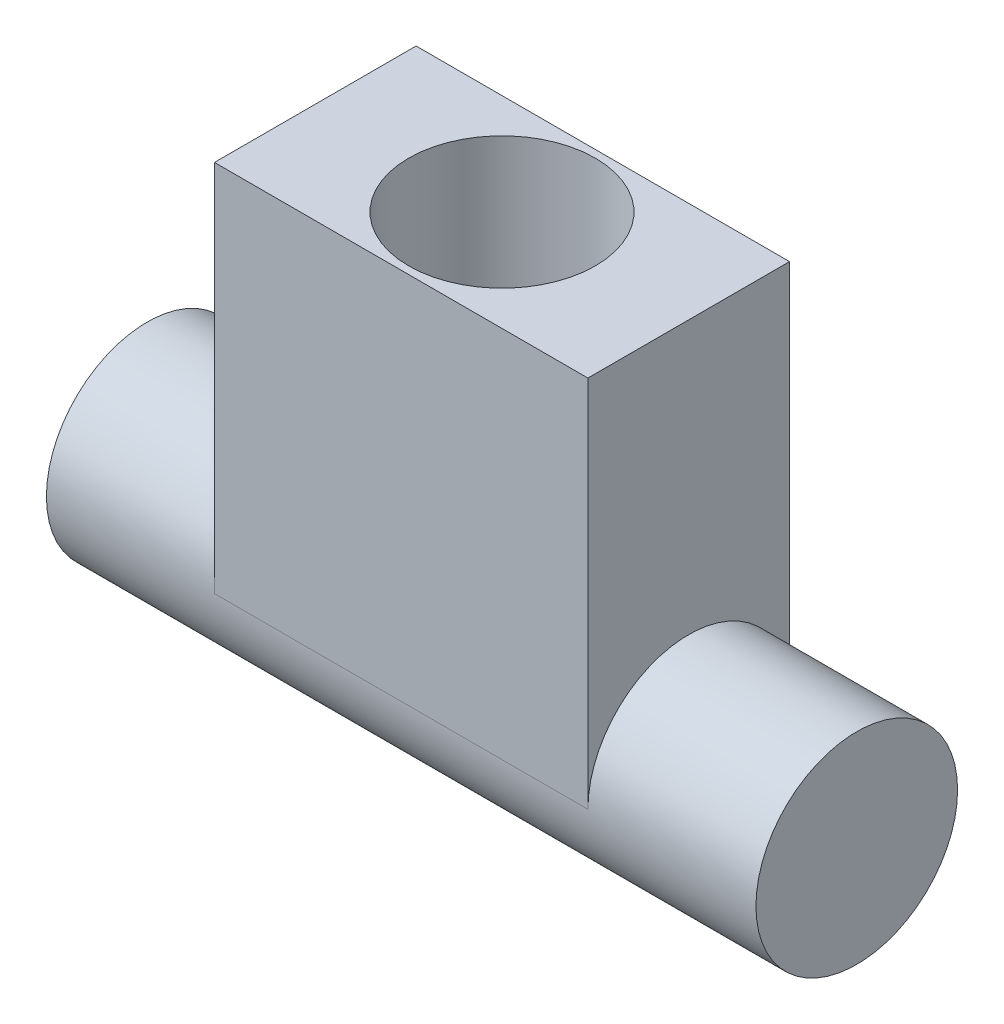
ISO-10303-21;
HEADER;
FILE_DESCRIPTION(('STEP AP214'),'2;1');
FILE_NAME('part.step','',(''),(''),'','','');
FILE_SCHEMA(('AUTOMOTIVE_DESIGN { 1 0 10303 214 1 1 1 1 }'));
ENDSEC;
DATA;
#1=APPLICATION_CONTEXT('core data for automotive mechanical design processes');
#2=APPLICATION_PROTOCOL_DEFINITION('international standard','automotive_design',2000,#1);
#3=PRODUCT_CONTEXT('',#1,'mechanical');
#4=PRODUCT('Part','Part','',(#3));
#5=PRODUCT_RELATED_PRODUCT_CATEGORY('part','',(#4));
#6=PRODUCT_DEFINITION_FORMATION('','',#4);
#7=PRODUCT_DEFINITION_CONTEXT('part definition',#1,'design');
#8=PRODUCT_DEFINITION('design','',#6,#7);
#9=PRODUCT_DEFINITION_SHAPE('','',#8);
#10=(LENGTH_UNIT() NAMED_UNIT(*) SI_UNIT(.MILLI.,.METRE.));
#11=(NAMED_UNIT(*) PLANE_ANGLE_UNIT() SI_UNIT($,.RADIAN.));
#12=(NAMED_UNIT(*) SI_UNIT($,.STERADIAN.) SOLID_ANGLE_UNIT());
#13=UNCERTAINTY_MEASURE_WITH_UNIT(LENGTH_MEASURE(1.E-05),#10,'distance_accuracy_value','');
#14=(GEOMETRIC_REPRESENTATION_CONTEXT(3) GLOBAL_UNCERTAINTY_ASSIGNED_CONTEXT((#13)) GLOBAL_UNIT_ASSIGNED_CONTEXT((#10,
#11,#12)) REPRESENTATION_CONTEXT('',''));
#15=CARTESIAN_POINT('',(0.,0.,0.));
#16=DIRECTION('',(0.,0.,1.));
#17=DIRECTION('',(1.,0.,0.));
#18=AXIS2_PLACEMENT_3D('',#15,#16,#17);
#19=CARTESIAN_POINT('',(19.,0.,0.));
#20=DIRECTION('',(-1.,0.,0.));
#21=DIRECTION('',(0.,0.,1.));
#22=AXIS2_PLACEMENT_3D('',#19,#20,#21);
#23=CYLINDRICAL_SURFACE('',#22,2.7);
#24=CARTESIAN_POINT('',(0.,0.,0.));
#25=DIRECTION('',(1.,0.,0.));
#26=DIRECTION('',(0.,0.,-1.));
#27=AXIS2_PLACEMENT_3D('',#24,#25,#26);
#28=CIRCLE('',#27,2.7);
#29=CARTESIAN_POINT('',(0.,0.,-2.7));
#30=VERTEX_POINT('',#29);
#31=EDGE_CURVE('E91',#30,#30,#28,.T.);
#32=ORIENTED_EDGE('',*,*,#31,.T.);
#33=EDGE_LOOP('',(#32));
#34=FACE_BOUND('',#33,.T.);
#35=CARTESIAN_POINT('',(19.,0.,0.));
#36=DIRECTION('',(1.,0.,0.));
#37=DIRECTION('',(0.,0.,-1.));
#38=AXIS2_PLACEMENT_3D('',#35,#36,#37);
#39=CIRCLE('',#38,2.7);
#40=CARTESIAN_POINT('',(19.,0.,-2.7));
#41=VERTEX_POINT('',#40);
#42=EDGE_CURVE('E94',#41,#41,#39,.T.);
#43=ORIENTED_EDGE('',*,*,#42,.F.);
#44=EDGE_LOOP('',(#43));
#45=FACE_BOUND('',#44,.T.);
#46=CARTESIAN_POINT('',(14.5,0.,0.));
#47=DIRECTION('',(-1.,0.,0.));
#48=DIRECTION('',(0.,0.,1.));
#49=AXIS2_PLACEMENT_3D('',#46,#47,#48);
#50=CIRCLE('',#49,2.7);
#51=CARTESIAN_POINT('',(14.5,0.,2.7));
#52=VERTEX_POINT('',#51);
#53=CARTESIAN_POINT('',(14.5,0.,-2.7));
#54=VERTEX_POINT('',#53);
#55=EDGE_CURVE('E11',#52,#54,#50,.T.);
#56=ORIENTED_EDGE('',*,*,#55,.F.);
#57=DIRECTION('',(1.,0.,0.));
#58=VECTOR('',#57,1.);
#59=CARTESIAN_POINT('',(4.5,0.,2.7));
#60=LINE('',#59,#58);
#61=CARTESIAN_POINT('',(4.5,0.,2.7));
#62=VERTEX_POINT('',#61);
#63=EDGE_CURVE('E88',#62,#52,#60,.T.);
#64=ORIENTED_EDGE('',*,*,#63,.F.);
#65=CARTESIAN_POINT('',(4.5,0.,0.));
#66=DIRECTION('',(1.,0.,0.));
#67=DIRECTION('',(0.,0.,-1.));
#68=AXIS2_PLACEMENT_3D('',#65,#66,#67);
#69=CIRCLE('',#68,2.7);
#70=CARTESIAN_POINT('',(4.5,0.,-2.7));
#71=VERTEX_POINT('',#70);
#72=EDGE_CURVE('E40',#71,#62,#69,.T.);
#73=ORIENTED_EDGE('',*,*,#72,.F.);
#74=DIRECTION('',(-1.,0.,0.));
#75=VECTOR('',#74,1.);
#76=CARTESIAN_POINT('',(4.5,0.,-2.7));
#77=LINE('',#76,#75);
#78=EDGE_CURVE('E47',#54,#71,#77,.T.);
#79=ORIENTED_EDGE('',*,*,#78,.F.);
#80=EDGE_LOOP('',(#56,#64,#73,#79));
#81=FACE_BOUND('',#80,.T.);
#82=ADVANCED_FACE('F33',(#34,#45,#81),#23,.T.);
#83=CARTESIAN_POINT('',(19.,0.,0.));
#84=DIRECTION('',(1.,0.,0.));
#85=DIRECTION('',(0.,0.,-1.));
#86=AXIS2_PLACEMENT_3D('',#83,#84,#85);
#87=PLANE('',#86);
#88=ORIENTED_EDGE('',*,*,#42,.T.);
#89=EDGE_LOOP('',(#88));
#90=FACE_BOUND('',#89,.T.);
#91=ADVANCED_FACE('F137',(#90),#87,.T.);
#92=CARTESIAN_POINT('',(0.,0.,0.));
#93=DIRECTION('',(1.,0.,0.));
#94=DIRECTION('',(0.,0.,-1.));
#95=AXIS2_PLACEMENT_3D('',#92,#93,#94);
#96=PLANE('',#95);
#97=ORIENTED_EDGE('',*,*,#31,.F.);
#98=EDGE_LOOP('',(#97));
#99=FACE_BOUND('',#98,.T.);
#100=ADVANCED_FACE('F142',(#99),#96,.F.);
#101=CARTESIAN_POINT('',(14.5,10.,-2.7));
#102=DIRECTION('',(-1.,0.,0.));
#103=DIRECTION('',(0.,0.,1.));
#104=AXIS2_PLACEMENT_3D('',#101,#102,#103);
#105=PLANE('',#104);
#106=DIRECTION('',(0.,-1.,0.));
#107=VECTOR('',#106,1.);
#108=CARTESIAN_POINT('',(14.5,10.,2.7));
#109=LINE('',#108,#107);
#110=CARTESIAN_POINT('',(14.5,10.,2.7));
#111=VERTEX_POINT('',#110);
#112=EDGE_CURVE('E108',#111,#52,#109,.T.);
#113=ORIENTED_EDGE('',*,*,#112,.T.);
#114=ORIENTED_EDGE('',*,*,#55,.T.);
#115=DIRECTION('',(0.,-1.,0.));
#116=VECTOR('',#115,1.);
#117=CARTESIAN_POINT('',(14.5,10.,-2.7));
#118=LINE('',#117,#116);
#119=CARTESIAN_POINT('',(14.5,10.,-2.7));
#120=VERTEX_POINT('',#119);
#121=EDGE_CURVE('E73',#120,#54,#118,.T.);
#122=ORIENTED_EDGE('',*,*,#121,.F.);
#123=DIRECTION('',(0.,0.,-1.));
#124=VECTOR('',#123,1.);
#125=CARTESIAN_POINT('',(14.5,10.,-2.7));
#126=LINE('',#125,#124);
#127=EDGE_CURVE('E79',#111,#120,#126,.T.);
#128=ORIENTED_EDGE('',*,*,#127,.F.);
#129=EDGE_LOOP('',(#113,#114,#122,#128));
#130=FACE_BOUND('',#129,.T.);
#131=ADVANCED_FACE('F90',(#130),#105,.F.);
#132=CARTESIAN_POINT('',(4.5,10.,-2.7));
#133=DIRECTION('',(0.,0.,1.));
#134=DIRECTION('',(1.,0.,0.));
#135=AXIS2_PLACEMENT_3D('',#132,#133,#134);
#136=PLANE('',#135);
#137=ORIENTED_EDGE('',*,*,#78,.T.);
#138=DIRECTION('',(0.,-1.,0.));
#139=VECTOR('',#138,1.);
#140=CARTESIAN_POINT('',(4.5,10.,-2.7));
#141=LINE('',#140,#139);
#142=CARTESIAN_POINT('',(4.5,10.,-2.7));
#143=VERTEX_POINT('',#142);
#144=EDGE_CURVE('E75',#143,#71,#141,.T.);
#145=ORIENTED_EDGE('',*,*,#144,.F.);
#146=DIRECTION('',(-1.,0.,0.));
#147=VECTOR('',#146,1.);
#148=CARTESIAN_POINT('',(4.5,10.,-2.7));
#149=LINE('',#148,#147);
#150=EDGE_CURVE('E69',#120,#143,#149,.T.);
#151=ORIENTED_EDGE('',*,*,#150,.F.);
#152=ORIENTED_EDGE('',*,*,#121,.T.);
#153=EDGE_LOOP('',(#137,#145,#151,#152));
#154=FACE_BOUND('',#153,.T.);
#155=ADVANCED_FACE('F71',(#154),#136,.F.);
#156=CARTESIAN_POINT('',(4.5,10.,-2.7));
#157=DIRECTION('',(1.,0.,0.));
#158=DIRECTION('',(0.,0.,-1.));
#159=AXIS2_PLACEMENT_3D('',#156,#157,#158);
#160=PLANE('',#159);
#161=ORIENTED_EDGE('',*,*,#144,.T.);
#162=ORIENTED_EDGE('',*,*,#72,.T.);
#163=DIRECTION('',(0.,-1.,0.));
#164=VECTOR('',#163,1.);
#165=CARTESIAN_POINT('',(4.5,10.,2.7));
#166=LINE('',#165,#164);
#167=CARTESIAN_POINT('',(4.5,10.,2.7));
#168=VERTEX_POINT('',#167);
#169=EDGE_CURVE('E96',#168,#62,#166,.T.);
#170=ORIENTED_EDGE('',*,*,#169,.F.);
#171=DIRECTION('',(0.,0.,1.));
#172=VECTOR('',#171,1.);
#173=CARTESIAN_POINT('',(4.5,10.,-2.7));
#174=LINE('',#173,#172);
#175=EDGE_CURVE('E78',#143,#168,#174,.T.);
#176=ORIENTED_EDGE('',*,*,#175,.F.);
#177=EDGE_LOOP('',(#161,#162,#170,#176));
#178=FACE_BOUND('',#177,.T.);
#179=ADVANCED_FACE('F104',(#178),#160,.F.);
#180=CARTESIAN_POINT('',(4.5,10.,2.7));
#181=DIRECTION('',(0.,0.,-1.));
#182=DIRECTION('',(-1.,0.,0.));
#183=AXIS2_PLACEMENT_3D('',#180,#181,#182);
#184=PLANE('',#183);
#185=ORIENTED_EDGE('',*,*,#63,.T.);
#186=ORIENTED_EDGE('',*,*,#112,.F.);
#187=DIRECTION('',(1.,0.,0.));
#188=VECTOR('',#187,1.);
#189=CARTESIAN_POINT('',(4.5,10.,2.7));
#190=LINE('',#189,#188);
#191=EDGE_CURVE('E84',#168,#111,#190,.T.);
#192=ORIENTED_EDGE('',*,*,#191,.F.);
#193=ORIENTED_EDGE('',*,*,#169,.T.);
#194=EDGE_LOOP('',(#185,#186,#192,#193));
#195=FACE_BOUND('',#194,.T.);
#196=ADVANCED_FACE('F107',(#195),#184,.F.);
#197=CARTESIAN_POINT('',(0.,10.,0.));
#198=DIRECTION('',(0.,1.,0.));
#199=DIRECTION('',(0.,0.,1.));
#200=AXIS2_PLACEMENT_3D('',#197,#198,#199);
#201=PLANE('',#200);
#202=CARTESIAN_POINT('',(9.5,10.,0.));
#203=DIRECTION('',(0.,1.,0.));
#204=DIRECTION('',(0.,0.,1.));
#205=AXIS2_PLACEMENT_3D('',#202,#203,#204);
#206=CIRCLE('',#205,2.5);
#207=CARTESIAN_POINT('',(9.5,10.,2.5));
#208=VERTEX_POINT('',#207);
#209=EDGE_CURVE('E116',#208,#208,#206,.T.);
#210=ORIENTED_EDGE('',*,*,#209,.F.);
#211=EDGE_LOOP('',(#210));
#212=FACE_BOUND('',#211,.T.);
#213=ORIENTED_EDGE('',*,*,#127,.T.);
#214=ORIENTED_EDGE('',*,*,#150,.T.);
#215=ORIENTED_EDGE('',*,*,#175,.T.);
#216=ORIENTED_EDGE('',*,*,#191,.T.);
#217=EDGE_LOOP('',(#213,#214,#215,#216));
#218=FACE_BOUND('',#217,.T.);
#219=ADVANCED_FACE('F82',(#212,#218),#201,.T.);
#220=CARTESIAN_POINT('',(9.5,5.,0.));
#221=DIRECTION('',(0.,1.,0.));
#222=DIRECTION('',(0.,0.,1.));
#223=AXIS2_PLACEMENT_3D('',#220,#221,#222);
#224=CYLINDRICAL_SURFACE('',#223,2.5);
#225=CARTESIAN_POINT('',(9.5,5.,0.));
#226=DIRECTION('',(0.,1.,0.));
#227=DIRECTION('',(0.,0.,1.));
#228=AXIS2_PLACEMENT_3D('',#225,#226,#227);
#229=CIRCLE('',#228,2.5);
#230=CARTESIAN_POINT('',(9.5,5.,2.5));
#231=VERTEX_POINT('',#230);
#232=EDGE_CURVE('E113',#231,#231,#229,.T.);
#233=ORIENTED_EDGE('',*,*,#232,.F.);
#234=EDGE_LOOP('',(#233));
#235=FACE_BOUND('',#234,.T.);
#236=ORIENTED_EDGE('',*,*,#209,.T.);
#237=EDGE_LOOP('',(#236));
#238=FACE_BOUND('',#237,.T.);
#239=ADVANCED_FACE('F124',(#235,#238),#224,.F.);
#240=CARTESIAN_POINT('',(9.5,5.,0.));
#241=DIRECTION('',(0.,1.,0.));
#242=DIRECTION('',(0.,0.,1.));
#243=AXIS2_PLACEMENT_3D('',#240,#241,#242);
#244=PLANE('',#243);
#245=ORIENTED_EDGE('',*,*,#232,.T.);
#246=EDGE_LOOP('',(#245));
#247=FACE_BOUND('',#246,.T.);
#248=ADVANCED_FACE('F122',(#247),#244,.T.);
#249=CLOSED_SHELL('',(#82,#91,#100,#131,#155,#179,#196,#219,#239,#248));
#250=MANIFOLD_SOLID_BREP('B2',#249);
#251=ADVANCED_BREP_SHAPE_REPRESENTATION('',(#18,#250),#14);
#252=SHAPE_DEFINITION_REPRESENTATION(#9,#251);
ENDSEC;
END-ISO-10303-21;
